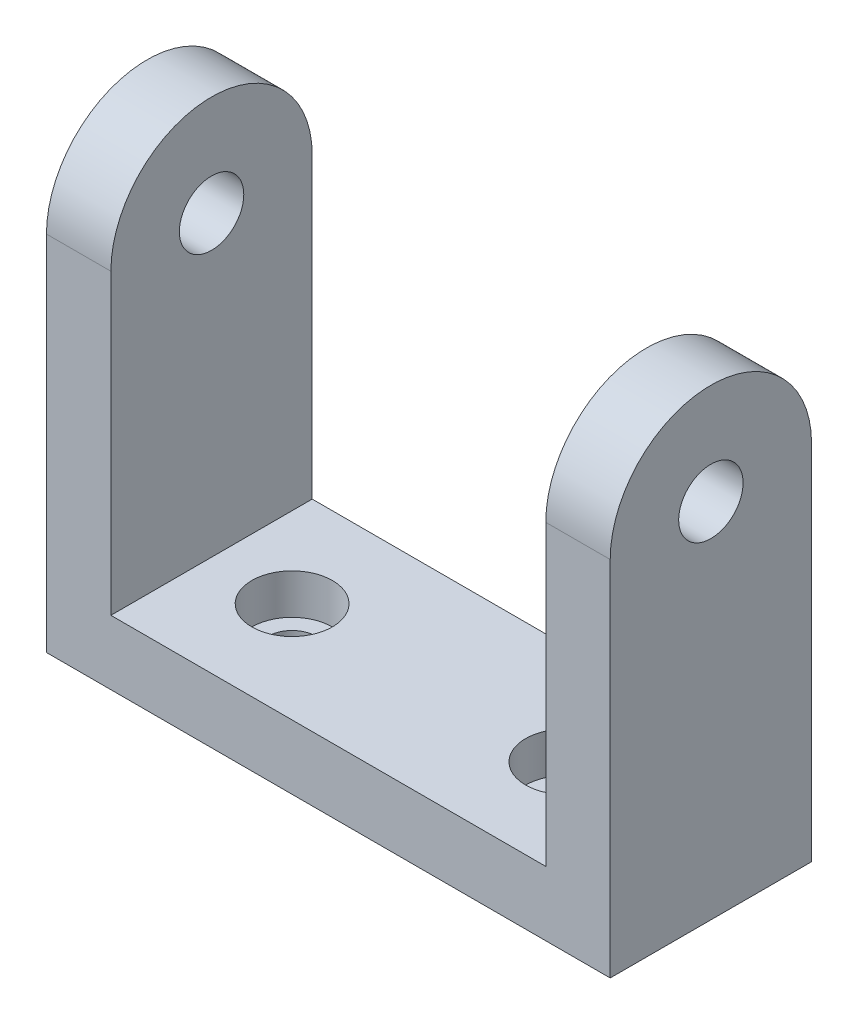
ISO-10303-21;
HEADER;
FILE_DESCRIPTION(('STEP AP214'),'2;1');
FILE_NAME('part.step','',(''),(''),'','','');
FILE_SCHEMA(('AUTOMOTIVE_DESIGN { 1 0 10303 214 1 1 1 1 }'));
ENDSEC;
DATA;
#1=APPLICATION_CONTEXT('core data for automotive mechanical design processes');
#2=APPLICATION_PROTOCOL_DEFINITION('international standard','automotive_design',2000,#1);
#3=PRODUCT_CONTEXT('',#1,'mechanical');
#4=PRODUCT('Part','Part','',(#3));
#5=PRODUCT_RELATED_PRODUCT_CATEGORY('part','',(#4));
#6=PRODUCT_DEFINITION_FORMATION('','',#4);
#7=PRODUCT_DEFINITION_CONTEXT('part definition',#1,'design');
#8=PRODUCT_DEFINITION('design','',#6,#7);
#9=PRODUCT_DEFINITION_SHAPE('','',#8);
#10=(LENGTH_UNIT() NAMED_UNIT(*) SI_UNIT(.MILLI.,.METRE.));
#11=(NAMED_UNIT(*) PLANE_ANGLE_UNIT() SI_UNIT($,.RADIAN.));
#12=(NAMED_UNIT(*) SI_UNIT($,.STERADIAN.) SOLID_ANGLE_UNIT());
#13=UNCERTAINTY_MEASURE_WITH_UNIT(LENGTH_MEASURE(1.E-05),#10,'distance_accuracy_value','');
#14=(GEOMETRIC_REPRESENTATION_CONTEXT(3) GLOBAL_UNCERTAINTY_ASSIGNED_CONTEXT((#13)) GLOBAL_UNIT_ASSIGNED_CONTEXT((#10,
#11,#12)) REPRESENTATION_CONTEXT('',''));
#15=CARTESIAN_POINT('',(0.,0.,0.));
#16=DIRECTION('',(0.,0.,1.));
#17=DIRECTION('',(1.,0.,0.));
#18=AXIS2_PLACEMENT_3D('',#15,#16,#17);
#19=CARTESIAN_POINT('',(0.,8.00000000000001,12.5));
#20=DIRECTION('',(0.,1.,0.));
#21=DIRECTION('',(-1.,0.,0.));
#22=AXIS2_PLACEMENT_3D('',#19,#20,#21);
#23=PLANE('',#22);
#24=DIRECTION('',(1.,0.,0.));
#25=VECTOR('',#24,1.);
#26=CARTESIAN_POINT('',(0.,8.00000000000001,-12.5));
#27=LINE('',#26,#25);
#28=CARTESIAN_POINT('',(-27.,7.9999999999996,-12.5));
#29=VERTEX_POINT('',#28);
#30=CARTESIAN_POINT('',(26.9999999999996,8.00000000000001,-12.5));
#31=VERTEX_POINT('',#30);
#32=EDGE_CURVE('E167',#29,#31,#27,.T.);
#33=ORIENTED_EDGE('',*,*,#32,.F.);
#34=DIRECTION('',(0.,0.,-1.));
#35=VECTOR('',#34,1.);
#36=CARTESIAN_POINT('',(-27.,7.9999999999996,12.5));
#37=LINE('',#36,#35);
#38=CARTESIAN_POINT('',(-27.,7.9999999999996,12.5));
#39=VERTEX_POINT('',#38);
#40=EDGE_CURVE('E175',#39,#29,#37,.T.);
#41=ORIENTED_EDGE('',*,*,#40,.F.);
#42=DIRECTION('',(1.,0.,0.));
#43=VECTOR('',#42,1.);
#44=CARTESIAN_POINT('',(0.,8.00000000000001,12.5));
#45=LINE('',#44,#43);
#46=CARTESIAN_POINT('',(27.,8.00000000000001,12.4999999999998));
#47=VERTEX_POINT('',#46);
#48=EDGE_CURVE('E149',#39,#47,#45,.T.);
#49=ORIENTED_EDGE('',*,*,#48,.T.);
#50=DIRECTION('',(0.,0.,-1.));
#51=VECTOR('',#50,1.);
#52=CARTESIAN_POINT('',(27.,8.00000000000001,12.4999999999998));
#53=LINE('',#52,#51);
#54=EDGE_CURVE('E122',#47,#31,#53,.T.);
#55=ORIENTED_EDGE('',*,*,#54,.T.);
#56=EDGE_LOOP('',(#33,#41,#49,#55));
#57=FACE_BOUND('',#56,.T.);
#58=CARTESIAN_POINT('',(-17.,8.00000000000001,0.));
#59=DIRECTION('',(0.,1.,0.));
#60=DIRECTION('',(-1.,0.,0.));
#61=AXIS2_PLACEMENT_3D('',#58,#59,#60);
#62=CIRCLE('',#61,5.);
#63=CARTESIAN_POINT('',(-22.,8.00000000000001,0.));
#64=VERTEX_POINT('',#63);
#65=EDGE_CURVE('E221',#64,#64,#62,.T.);
#66=ORIENTED_EDGE('',*,*,#65,.F.);
#67=EDGE_LOOP('',(#66));
#68=FACE_BOUND('',#67,.T.);
#69=CARTESIAN_POINT('',(17.,8.00000000000001,-2.0122792321331E-13));
#70=DIRECTION('',(0.,-1.,0.));
#71=DIRECTION('',(1.,0.,0.));
#72=AXIS2_PLACEMENT_3D('',#69,#70,#71);
#73=CIRCLE('',#72,5.);
#74=CARTESIAN_POINT('',(22.,8.00000000000001,-2.0122792321331E-13));
#75=VERTEX_POINT('',#74);
#76=EDGE_CURVE('E214',#75,#75,#73,.T.);
#77=ORIENTED_EDGE('',*,*,#76,.T.);
#78=EDGE_LOOP('',(#77));
#79=FACE_BOUND('',#78,.T.);
#80=ADVANCED_FACE('F44',(#57,#68,#79),#23,.T.);
#81=CARTESIAN_POINT('',(-17.,0.,0.));
#82=DIRECTION('',(0.,1.,0.));
#83=DIRECTION('',(-1.,0.,0.));
#84=AXIS2_PLACEMENT_3D('',#81,#82,#83);
#85=CYLINDRICAL_SURFACE('',#84,3.);
#86=CARTESIAN_POINT('',(-17.,0.,0.));
#87=DIRECTION('',(0.,1.,0.));
#88=DIRECTION('',(-1.,0.,0.));
#89=AXIS2_PLACEMENT_3D('',#86,#87,#88);
#90=CIRCLE('',#89,3.);
#91=CARTESIAN_POINT('',(-20.,0.,0.));
#92=VERTEX_POINT('',#91);
#93=EDGE_CURVE('E212',#92,#92,#90,.T.);
#94=ORIENTED_EDGE('',*,*,#93,.F.);
#95=EDGE_LOOP('',(#94));
#96=FACE_BOUND('',#95,.T.);
#97=CARTESIAN_POINT('',(-17.,3.,0.));
#98=DIRECTION('',(0.,1.,0.));
#99=DIRECTION('',(-1.,0.,0.));
#100=AXIS2_PLACEMENT_3D('',#97,#98,#99);
#101=CIRCLE('',#100,3.);
#102=CARTESIAN_POINT('',(-20.,3.,0.));
#103=VERTEX_POINT('',#102);
#104=EDGE_CURVE('E49',#103,#103,#101,.F.);
#105=ORIENTED_EDGE('',*,*,#104,.F.);
#106=EDGE_LOOP('',(#105));
#107=FACE_BOUND('',#106,.T.);
#108=ADVANCED_FACE('F277',(#96,#107),#85,.F.);
#109=CARTESIAN_POINT('',(0.,0.,12.5));
#110=DIRECTION('',(0.,-1.,0.));
#111=DIRECTION('',(1.,0.,0.));
#112=AXIS2_PLACEMENT_3D('',#109,#110,#111);
#113=PLANE('',#112);
#114=DIRECTION('',(-1.,0.,0.));
#115=VECTOR('',#114,1.);
#116=CARTESIAN_POINT('',(0.,0.,-12.5000000000001));
#117=LINE('',#116,#115);
#118=CARTESIAN_POINT('',(35.,0.,-12.5000000000001));
#119=VERTEX_POINT('',#118);
#120=CARTESIAN_POINT('',(-35.,-4.16333634234434E-13,-12.5000000000001));
#121=VERTEX_POINT('',#120);
#122=EDGE_CURVE('E118',#119,#121,#117,.T.);
#123=ORIENTED_EDGE('',*,*,#122,.F.);
#124=DIRECTION('',(0.,0.,-1.));
#125=VECTOR('',#124,1.);
#126=CARTESIAN_POINT('',(35.,0.,12.5));
#127=LINE('',#126,#125);
#128=CARTESIAN_POINT('',(35.,0.,12.5));
#129=VERTEX_POINT('',#128);
#130=EDGE_CURVE('E111',#129,#119,#127,.T.);
#131=ORIENTED_EDGE('',*,*,#130,.F.);
#132=DIRECTION('',(-1.,0.,0.));
#133=VECTOR('',#132,1.);
#134=CARTESIAN_POINT('',(0.,0.,12.5));
#135=LINE('',#134,#133);
#136=CARTESIAN_POINT('',(-35.,-4.02455846426619E-13,12.5));
#137=VERTEX_POINT('',#136);
#138=EDGE_CURVE('E115',#129,#137,#135,.T.);
#139=ORIENTED_EDGE('',*,*,#138,.T.);
#140=DIRECTION('',(0.,0.,-1.));
#141=VECTOR('',#140,1.);
#142=CARTESIAN_POINT('',(-35.,-4.02455846426619E-13,12.5));
#143=LINE('',#142,#141);
#144=EDGE_CURVE('E158',#137,#121,#143,.T.);
#145=ORIENTED_EDGE('',*,*,#144,.T.);
#146=EDGE_LOOP('',(#123,#131,#139,#145));
#147=FACE_BOUND('',#146,.T.);
#148=ORIENTED_EDGE('',*,*,#93,.T.);
#149=EDGE_LOOP('',(#148));
#150=FACE_BOUND('',#149,.T.);
#151=CARTESIAN_POINT('',(17.,0.,-2.0122792321331E-13));
#152=DIRECTION('',(0.,-1.,0.));
#153=DIRECTION('',(1.,0.,0.));
#154=AXIS2_PLACEMENT_3D('',#151,#152,#153);
#155=CIRCLE('',#154,3.);
#156=CARTESIAN_POINT('',(20.,0.,-2.0122792321331E-13));
#157=VERTEX_POINT('',#156);
#158=EDGE_CURVE('E231',#157,#157,#155,.T.);
#159=ORIENTED_EDGE('',*,*,#158,.F.);
#160=EDGE_LOOP('',(#159));
#161=FACE_BOUND('',#160,.T.);
#162=ADVANCED_FACE('F112',(#147,#150,#161),#113,.T.);
#163=CARTESIAN_POINT('',(27.,45.,0.));
#164=DIRECTION('',(-1.,0.,0.));
#165=DIRECTION('',(0.,0.,1.));
#166=AXIS2_PLACEMENT_3D('',#163,#164,#165);
#167=CYLINDRICAL_SURFACE('',#166,12.5);
#168=DIRECTION('',(-1.,0.,0.));
#169=VECTOR('',#168,1.);
#170=CARTESIAN_POINT('',(0.,45.,-12.5));
#171=LINE('',#170,#169);
#172=CARTESIAN_POINT('',(27.,45.,-12.5));
#173=VERTEX_POINT('',#172);
#174=CARTESIAN_POINT('',(35.,45.,-12.5));
#175=VERTEX_POINT('',#174);
#176=EDGE_CURVE('E194',#173,#175,#171,.F.);
#177=ORIENTED_EDGE('',*,*,#176,.F.);
#178=CARTESIAN_POINT('',(27.,45.,0.));
#179=DIRECTION('',(1.,0.,0.));
#180=DIRECTION('',(0.,1.,0.));
#181=AXIS2_PLACEMENT_3D('',#178,#179,#180);
#182=CIRCLE('',#181,12.5);
#183=CARTESIAN_POINT('',(27.,45.,12.5));
#184=VERTEX_POINT('',#183);
#185=EDGE_CURVE('E55',#184,#173,#182,.F.);
#186=ORIENTED_EDGE('',*,*,#185,.F.);
#187=DIRECTION('',(1.,0.,0.));
#188=VECTOR('',#187,1.);
#189=CARTESIAN_POINT('',(27.,45.,12.5));
#190=LINE('',#189,#188);
#191=CARTESIAN_POINT('',(35.,45.,12.5));
#192=VERTEX_POINT('',#191);
#193=EDGE_CURVE('E198',#192,#184,#190,.F.);
#194=ORIENTED_EDGE('',*,*,#193,.F.);
#195=CARTESIAN_POINT('',(35.,45.,0.));
#196=DIRECTION('',(-1.,0.,0.));
#197=DIRECTION('',(0.,-1.,0.));
#198=AXIS2_PLACEMENT_3D('',#195,#196,#197);
#199=CIRCLE('',#198,12.5);
#200=EDGE_CURVE('E11',#175,#192,#199,.F.);
#201=ORIENTED_EDGE('',*,*,#200,.F.);
#202=EDGE_LOOP('',(#177,#186,#194,#201));
#203=FACE_BOUND('',#202,.T.);
#204=ADVANCED_FACE('F47',(#203),#167,.T.);
#205=CARTESIAN_POINT('',(-27.,44.9999999999996,0.));
#206=DIRECTION('',(1.,0.,0.));
#207=DIRECTION('',(0.,0.,-1.));
#208=AXIS2_PLACEMENT_3D('',#205,#206,#207);
#209=CYLINDRICAL_SURFACE('',#208,12.5);
#210=DIRECTION('',(1.,0.,0.));
#211=VECTOR('',#210,1.);
#212=CARTESIAN_POINT('',(0.,45.,12.5));
#213=LINE('',#212,#211);
#214=CARTESIAN_POINT('',(-27.,44.9999999999996,12.5));
#215=VERTEX_POINT('',#214);
#216=CARTESIAN_POINT('',(-35.,45.,12.5));
#217=VERTEX_POINT('',#216);
#218=EDGE_CURVE('E121',#215,#217,#213,.F.);
#219=ORIENTED_EDGE('',*,*,#218,.F.);
#220=CARTESIAN_POINT('',(-27.,44.9999999999996,0.));
#221=DIRECTION('',(1.,0.,0.));
#222=DIRECTION('',(0.,1.,0.));
#223=AXIS2_PLACEMENT_3D('',#220,#221,#222);
#224=CIRCLE('',#223,12.5);
#225=CARTESIAN_POINT('',(-27.,44.9999999999996,-12.5));
#226=VERTEX_POINT('',#225);
#227=EDGE_CURVE('E188',#226,#215,#224,.T.);
#228=ORIENTED_EDGE('',*,*,#227,.F.);
#229=DIRECTION('',(-1.,0.,0.));
#230=VECTOR('',#229,1.);
#231=CARTESIAN_POINT('',(-27.,44.9999999999996,-12.5));
#232=LINE('',#231,#230);
#233=CARTESIAN_POINT('',(-35.,45.,-12.5000000000001));
#234=VERTEX_POINT('',#233);
#235=EDGE_CURVE('E184',#234,#226,#232,.F.);
#236=ORIENTED_EDGE('',*,*,#235,.F.);
#237=CARTESIAN_POINT('',(-35.,45.,0.));
#238=DIRECTION('',(-1.,0.,0.));
#239=DIRECTION('',(0.,-1.,0.));
#240=AXIS2_PLACEMENT_3D('',#237,#238,#239);
#241=CIRCLE('',#240,12.5);
#242=EDGE_CURVE('E191',#217,#234,#241,.T.);
#243=ORIENTED_EDGE('',*,*,#242,.F.);
#244=EDGE_LOOP('',(#219,#228,#236,#243));
#245=FACE_BOUND('',#244,.T.);
#246=ADVANCED_FACE('F294',(#245),#209,.T.);
#247=CARTESIAN_POINT('',(35.,0.,12.5));
#248=DIRECTION('',(-1.,0.,0.));
#249=DIRECTION('',(0.,-1.,0.));
#250=AXIS2_PLACEMENT_3D('',#247,#248,#249);
#251=PLANE('',#250);
#252=CARTESIAN_POINT('',(35.,45.,0.));
#253=DIRECTION('',(-1.,0.,0.));
#254=DIRECTION('',(0.,-1.,0.));
#255=AXIS2_PLACEMENT_3D('',#252,#253,#254);
#256=CIRCLE('',#255,4.);
#257=CARTESIAN_POINT('',(35.,41.,0.));
#258=VERTEX_POINT('',#257);
#259=EDGE_CURVE('E239',#258,#258,#256,.T.);
#260=ORIENTED_EDGE('',*,*,#259,.T.);
#261=EDGE_LOOP('',(#260));
#262=FACE_BOUND('',#261,.T.);
#263=DIRECTION('',(0.,1.,0.));
#264=VECTOR('',#263,1.);
#265=CARTESIAN_POINT('',(35.,0.,-12.5000000000001));
#266=LINE('',#265,#264);
#267=EDGE_CURVE('E161',#119,#175,#266,.T.);
#268=ORIENTED_EDGE('',*,*,#267,.T.);
#269=ORIENTED_EDGE('',*,*,#200,.T.);
#270=DIRECTION('',(0.,1.,0.));
#271=VECTOR('',#270,1.);
#272=CARTESIAN_POINT('',(35.,0.,12.5));
#273=LINE('',#272,#271);
#274=EDGE_CURVE('E125',#129,#192,#273,.T.);
#275=ORIENTED_EDGE('',*,*,#274,.F.);
#276=ORIENTED_EDGE('',*,*,#130,.T.);
#277=EDGE_LOOP('',(#268,#269,#275,#276));
#278=FACE_BOUND('',#277,.T.);
#279=ADVANCED_FACE('F126',(#262,#278),#251,.F.);
#280=CARTESIAN_POINT('',(27.,0.,12.5));
#281=DIRECTION('',(1.,0.,0.));
#282=DIRECTION('',(0.,1.,0.));
#283=AXIS2_PLACEMENT_3D('',#280,#281,#282);
#284=PLANE('',#283);
#285=CARTESIAN_POINT('',(27.,45.,0.));
#286=DIRECTION('',(1.,0.,0.));
#287=DIRECTION('',(0.,1.,0.));
#288=AXIS2_PLACEMENT_3D('',#285,#286,#287);
#289=CIRCLE('',#288,4.);
#290=CARTESIAN_POINT('',(27.,49.,0.));
#291=VERTEX_POINT('',#290);
#292=EDGE_CURVE('E144',#291,#291,#289,.T.);
#293=ORIENTED_EDGE('',*,*,#292,.T.);
#294=EDGE_LOOP('',(#293));
#295=FACE_BOUND('',#294,.T.);
#296=DIRECTION('',(0.,-1.,0.));
#297=VECTOR('',#296,1.);
#298=CARTESIAN_POINT('',(27.,0.,12.5));
#299=LINE('',#298,#297);
#300=EDGE_CURVE('E129',#184,#47,#299,.T.);
#301=ORIENTED_EDGE('',*,*,#300,.F.);
#302=ORIENTED_EDGE('',*,*,#185,.T.);
#303=DIRECTION('',(0.,-1.,0.));
#304=VECTOR('',#303,1.);
#305=CARTESIAN_POINT('',(27.,0.,-12.5000000000001));
#306=LINE('',#305,#304);
#307=EDGE_CURVE('E164',#173,#31,#306,.T.);
#308=ORIENTED_EDGE('',*,*,#307,.T.);
#309=ORIENTED_EDGE('',*,*,#54,.F.);
#310=EDGE_LOOP('',(#301,#302,#308,#309));
#311=FACE_BOUND('',#310,.T.);
#312=ADVANCED_FACE('F256',(#295,#311),#284,.F.);
#313=CARTESIAN_POINT('',(-27.,-4.16333634234434E-13,12.5));
#314=DIRECTION('',(1.,0.,0.));
#315=DIRECTION('',(0.,1.,0.));
#316=AXIS2_PLACEMENT_3D('',#313,#314,#315);
#317=PLANE('',#316);
#318=CARTESIAN_POINT('',(-27.,44.9999999999996,0.));
#319=DIRECTION('',(1.,0.,0.));
#320=DIRECTION('',(0.,1.,0.));
#321=AXIS2_PLACEMENT_3D('',#318,#319,#320);
#322=CIRCLE('',#321,4.);
#323=CARTESIAN_POINT('',(-27.,48.9999999999996,0.));
#324=VERTEX_POINT('',#323);
#325=EDGE_CURVE('E243',#324,#324,#322,.T.);
#326=ORIENTED_EDGE('',*,*,#325,.F.);
#327=EDGE_LOOP('',(#326));
#328=FACE_BOUND('',#327,.T.);
#329=DIRECTION('',(0.,-1.,0.));
#330=VECTOR('',#329,1.);
#331=CARTESIAN_POINT('',(-27.,-4.16333634234434E-13,-12.5000000000001));
#332=LINE('',#331,#330);
#333=EDGE_CURVE('E141',#226,#29,#332,.T.);
#334=ORIENTED_EDGE('',*,*,#333,.F.);
#335=ORIENTED_EDGE('',*,*,#227,.T.);
#336=DIRECTION('',(0.,-1.,0.));
#337=VECTOR('',#336,1.);
#338=CARTESIAN_POINT('',(-27.,-4.16333634234434E-13,12.5));
#339=LINE('',#338,#337);
#340=EDGE_CURVE('E153',#215,#39,#339,.T.);
#341=ORIENTED_EDGE('',*,*,#340,.T.);
#342=ORIENTED_EDGE('',*,*,#40,.T.);
#343=EDGE_LOOP('',(#334,#335,#341,#342));
#344=FACE_BOUND('',#343,.T.);
#345=ADVANCED_FACE('F288',(#328,#344),#317,.T.);
#346=CARTESIAN_POINT('',(-35.,-3.88578058618805E-13,12.5));
#347=DIRECTION('',(-1.,0.,0.));
#348=DIRECTION('',(0.,-1.,0.));
#349=AXIS2_PLACEMENT_3D('',#346,#347,#348);
#350=PLANE('',#349);
#351=CARTESIAN_POINT('',(-35.,45.,0.));
#352=DIRECTION('',(-1.,0.,0.));
#353=DIRECTION('',(0.,-1.,0.));
#354=AXIS2_PLACEMENT_3D('',#351,#352,#353);
#355=CIRCLE('',#354,4.);
#356=CARTESIAN_POINT('',(-35.,41.,0.));
#357=VERTEX_POINT('',#356);
#358=EDGE_CURVE('E235',#357,#357,#355,.T.);
#359=ORIENTED_EDGE('',*,*,#358,.F.);
#360=EDGE_LOOP('',(#359));
#361=FACE_BOUND('',#360,.T.);
#362=DIRECTION('',(0.,1.,0.));
#363=VECTOR('',#362,1.);
#364=CARTESIAN_POINT('',(-35.,-3.88578058618805E-13,12.5));
#365=LINE('',#364,#363);
#366=EDGE_CURVE('E134',#137,#217,#365,.T.);
#367=ORIENTED_EDGE('',*,*,#366,.T.);
#368=ORIENTED_EDGE('',*,*,#242,.T.);
#369=DIRECTION('',(0.,1.,0.));
#370=VECTOR('',#369,1.);
#371=CARTESIAN_POINT('',(-35.,-3.88578058618805E-13,-12.5000000000001));
#372=LINE('',#371,#370);
#373=EDGE_CURVE('E136',#121,#234,#372,.T.);
#374=ORIENTED_EDGE('',*,*,#373,.F.);
#375=ORIENTED_EDGE('',*,*,#144,.F.);
#376=EDGE_LOOP('',(#367,#368,#374,#375));
#377=FACE_BOUND('',#376,.T.);
#378=ADVANCED_FACE('F317',(#361,#377),#350,.T.);
#379=CARTESIAN_POINT('',(0.,0.,12.5));
#380=DIRECTION('',(0.,0.,1.));
#381=DIRECTION('',(1.,0.,0.));
#382=AXIS2_PLACEMENT_3D('',#379,#380,#381);
#383=PLANE('',#382);
#384=ORIENTED_EDGE('',*,*,#274,.T.);
#385=ORIENTED_EDGE('',*,*,#193,.T.);
#386=ORIENTED_EDGE('',*,*,#300,.T.);
#387=ORIENTED_EDGE('',*,*,#48,.F.);
#388=ORIENTED_EDGE('',*,*,#340,.F.);
#389=ORIENTED_EDGE('',*,*,#218,.T.);
#390=ORIENTED_EDGE('',*,*,#366,.F.);
#391=ORIENTED_EDGE('',*,*,#138,.F.);
#392=EDGE_LOOP('',(#384,#385,#386,#387,#388,#389,#390,#391));
#393=FACE_BOUND('',#392,.T.);
#394=ADVANCED_FACE('F131',(#393),#383,.T.);
#395=CARTESIAN_POINT('',(0.,0.,-12.5000000000001));
#396=DIRECTION('',(0.,0.,1.));
#397=DIRECTION('',(1.,0.,0.));
#398=AXIS2_PLACEMENT_3D('',#395,#396,#397);
#399=PLANE('',#398);
#400=ORIENTED_EDGE('',*,*,#307,.F.);
#401=ORIENTED_EDGE('',*,*,#176,.T.);
#402=ORIENTED_EDGE('',*,*,#267,.F.);
#403=ORIENTED_EDGE('',*,*,#122,.T.);
#404=ORIENTED_EDGE('',*,*,#373,.T.);
#405=ORIENTED_EDGE('',*,*,#235,.T.);
#406=ORIENTED_EDGE('',*,*,#333,.T.);
#407=ORIENTED_EDGE('',*,*,#32,.T.);
#408=EDGE_LOOP('',(#400,#401,#402,#403,#404,#405,#406,#407));
#409=FACE_BOUND('',#408,.T.);
#410=ADVANCED_FACE('F272',(#409),#399,.F.);
#411=CARTESIAN_POINT('',(35.,45.,0.));
#412=DIRECTION('',(-1.,0.,0.));
#413=DIRECTION('',(0.,-1.,0.));
#414=AXIS2_PLACEMENT_3D('',#411,#412,#413);
#415=CYLINDRICAL_SURFACE('',#414,4.);
#416=ORIENTED_EDGE('',*,*,#325,.T.);
#417=EDGE_LOOP('',(#416));
#418=FACE_BOUND('',#417,.T.);
#419=ORIENTED_EDGE('',*,*,#358,.T.);
#420=EDGE_LOOP('',(#419));
#421=FACE_BOUND('',#420,.T.);
#422=ADVANCED_FACE('F262',(#418,#421),#415,.F.);
#423=ORIENTED_EDGE('',*,*,#259,.F.);
#424=EDGE_LOOP('',(#423));
#425=FACE_BOUND('',#424,.T.);
#426=ORIENTED_EDGE('',*,*,#292,.F.);
#427=EDGE_LOOP('',(#426));
#428=FACE_BOUND('',#427,.T.);
#429=ADVANCED_FACE('F259',(#425,#428),#415,.F.);
#430=CARTESIAN_POINT('',(17.,0.,-2.0122792321331E-13));
#431=DIRECTION('',(0.,1.,0.));
#432=DIRECTION('',(-1.,0.,0.));
#433=AXIS2_PLACEMENT_3D('',#430,#431,#432);
#434=CYLINDRICAL_SURFACE('',#433,3.);
#435=CARTESIAN_POINT('',(17.,3.,-2.0122792321331E-13));
#436=DIRECTION('',(0.,-1.,0.));
#437=DIRECTION('',(1.,0.,0.));
#438=AXIS2_PLACEMENT_3D('',#435,#436,#437);
#439=CIRCLE('',#438,3.);
#440=CARTESIAN_POINT('',(20.,3.,-2.0122792321331E-13));
#441=VERTEX_POINT('',#440);
#442=EDGE_CURVE('E202',#441,#441,#439,.T.);
#443=ORIENTED_EDGE('',*,*,#442,.F.);
#444=EDGE_LOOP('',(#443));
#445=FACE_BOUND('',#444,.T.);
#446=ORIENTED_EDGE('',*,*,#158,.T.);
#447=EDGE_LOOP('',(#446));
#448=FACE_BOUND('',#447,.T.);
#449=ADVANCED_FACE('F261',(#445,#448),#434,.F.);
#450=CARTESIAN_POINT('',(17.,3.,-2.0122792321331E-13));
#451=DIRECTION('',(0.,1.,0.));
#452=DIRECTION('',(-1.,0.,0.));
#453=AXIS2_PLACEMENT_3D('',#450,#451,#452);
#454=CYLINDRICAL_SURFACE('',#453,5.);
#455=CARTESIAN_POINT('',(17.,3.,-2.0122792321331E-13));
#456=DIRECTION('',(0.,-1.,0.));
#457=DIRECTION('',(1.,0.,0.));
#458=AXIS2_PLACEMENT_3D('',#455,#456,#457);
#459=CIRCLE('',#458,5.);
#460=CARTESIAN_POINT('',(22.,3.,-2.0122792321331E-13));
#461=VERTEX_POINT('',#460);
#462=EDGE_CURVE('E205',#461,#461,#459,.T.);
#463=ORIENTED_EDGE('',*,*,#462,.T.);
#464=EDGE_LOOP('',(#463));
#465=FACE_BOUND('',#464,.T.);
#466=ORIENTED_EDGE('',*,*,#76,.F.);
#467=EDGE_LOOP('',(#466));
#468=FACE_BOUND('',#467,.T.);
#469=ADVANCED_FACE('F269',(#465,#468),#454,.F.);
#470=CARTESIAN_POINT('',(17.,3.,-2.0122792321331E-13));
#471=DIRECTION('',(0.,-1.,0.));
#472=DIRECTION('',(1.,0.,0.));
#473=AXIS2_PLACEMENT_3D('',#470,#471,#472);
#474=PLANE('',#473);
#475=ORIENTED_EDGE('',*,*,#442,.T.);
#476=EDGE_LOOP('',(#475));
#477=FACE_BOUND('',#476,.T.);
#478=ORIENTED_EDGE('',*,*,#462,.F.);
#479=EDGE_LOOP('',(#478));
#480=FACE_BOUND('',#479,.T.);
#481=ADVANCED_FACE('F358',(#477,#480),#474,.F.);
#482=CARTESIAN_POINT('',(-17.,3.,0.));
#483=DIRECTION('',(0.,1.,0.));
#484=DIRECTION('',(-1.,0.,0.));
#485=AXIS2_PLACEMENT_3D('',#482,#483,#484);
#486=PLANE('',#485);
#487=CARTESIAN_POINT('',(-17.,3.,0.));
#488=DIRECTION('',(0.,1.,0.));
#489=DIRECTION('',(-1.,0.,0.));
#490=AXIS2_PLACEMENT_3D('',#487,#488,#489);
#491=CIRCLE('',#490,5.);
#492=CARTESIAN_POINT('',(-22.,3.,0.));
#493=VERTEX_POINT('',#492);
#494=EDGE_CURVE('E227',#493,#493,#491,.T.);
#495=ORIENTED_EDGE('',*,*,#494,.T.);
#496=EDGE_LOOP('',(#495));
#497=FACE_BOUND('',#496,.T.);
#498=ORIENTED_EDGE('',*,*,#104,.T.);
#499=EDGE_LOOP('',(#498));
#500=FACE_BOUND('',#499,.T.);
#501=ADVANCED_FACE('F368',(#497,#500),#486,.T.);
#502=CARTESIAN_POINT('',(-17.,3.,0.));
#503=DIRECTION('',(0.,1.,0.));
#504=DIRECTION('',(-1.,0.,0.));
#505=AXIS2_PLACEMENT_3D('',#502,#503,#504);
#506=CYLINDRICAL_SURFACE('',#505,5.);
#507=ORIENTED_EDGE('',*,*,#494,.F.);
#508=EDGE_LOOP('',(#507));
#509=FACE_BOUND('',#508,.T.);
#510=ORIENTED_EDGE('',*,*,#65,.T.);
#511=EDGE_LOOP('',(#510));
#512=FACE_BOUND('',#511,.T.);
#513=ADVANCED_FACE('F377',(#509,#512),#506,.F.);
#514=CLOSED_SHELL('',(#80,#108,#162,#204,#246,#279,#312,#345,#378,#394,#410,#422,#429,#449,#469,
#481,#501,#513));
#515=MANIFOLD_SOLID_BREP('B2',#514);
#516=ADVANCED_BREP_SHAPE_REPRESENTATION('',(#18,#515),#14);
#517=SHAPE_DEFINITION_REPRESENTATION(#9,#516);
ENDSEC;
END-ISO-10303-21;
